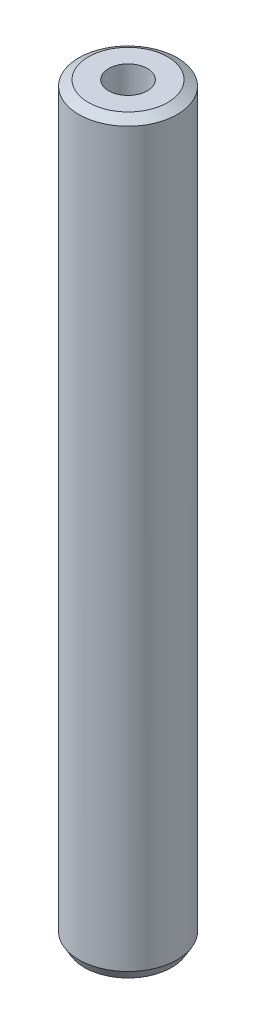
ISO-10303-21;
HEADER;
FILE_DESCRIPTION(('STEP AP214'),'2;1');
FILE_NAME('part.step','',(''),(''),'','','');
FILE_SCHEMA(('AUTOMOTIVE_DESIGN { 1 0 10303 214 1 1 1 1 }'));
ENDSEC;
DATA;
#1=APPLICATION_CONTEXT('core data for automotive mechanical design processes');
#2=APPLICATION_PROTOCOL_DEFINITION('international standard','automotive_design',2000,#1);
#3=PRODUCT_CONTEXT('',#1,'mechanical');
#4=PRODUCT('Part','Part','',(#3));
#5=PRODUCT_RELATED_PRODUCT_CATEGORY('part','',(#4));
#6=PRODUCT_DEFINITION_FORMATION('','',#4);
#7=PRODUCT_DEFINITION_CONTEXT('part definition',#1,'design');
#8=PRODUCT_DEFINITION('design','',#6,#7);
#9=PRODUCT_DEFINITION_SHAPE('','',#8);
#10=(LENGTH_UNIT() NAMED_UNIT(*) SI_UNIT(.MILLI.,.METRE.));
#11=(NAMED_UNIT(*) PLANE_ANGLE_UNIT() SI_UNIT($,.RADIAN.));
#12=(NAMED_UNIT(*) SI_UNIT($,.STERADIAN.) SOLID_ANGLE_UNIT());
#13=UNCERTAINTY_MEASURE_WITH_UNIT(LENGTH_MEASURE(1.E-05),#10,'distance_accuracy_value','');
#14=(GEOMETRIC_REPRESENTATION_CONTEXT(3) GLOBAL_UNCERTAINTY_ASSIGNED_CONTEXT((#13)) GLOBAL_UNIT_ASSIGNED_CONTEXT((#10,
#11,#12)) REPRESENTATION_CONTEXT('',''));
#15=CARTESIAN_POINT('',(0.,0.,0.));
#16=DIRECTION('',(0.,0.,1.));
#17=DIRECTION('',(1.,0.,0.));
#18=AXIS2_PLACEMENT_3D('',#15,#16,#17);
#19=CARTESIAN_POINT('',(0.,417.847683624445,0.));
#20=DIRECTION('',(0.,-1.,0.));
#21=DIRECTION('',(0.,0.,-1.));
#22=AXIS2_PLACEMENT_3D('',#19,#20,#21);
#23=CYLINDRICAL_SURFACE('',#22,27.5);
#24=CARTESIAN_POINT('',(0.,414.725845163587,0.));
#25=DIRECTION('',(0.,1.,0.));
#26=DIRECTION('',(0.,0.,1.));
#27=AXIS2_PLACEMENT_3D('',#24,#25,#26);
#28=CIRCLE('',#27,27.5);
#29=CARTESIAN_POINT('',(0.,414.725845163587,-27.5));
#30=VERTEX_POINT('',#29);
#31=EDGE_CURVE('E50',#30,#30,#28,.F.);
#32=CARTESIAN_POINT('',(0.,5.34554521155284,0.));
#33=DIRECTION('',(0.,1.,0.));
#34=DIRECTION('',(0.,0.,1.));
#35=AXIS2_PLACEMENT_3D('',#32,#33,#34);
#36=CIRCLE('',#35,27.5);
#37=CARTESIAN_POINT('',(0.,5.34554521155284,-27.5));
#38=VERTEX_POINT('',#37);
#39=EDGE_CURVE('E51',#38,#38,#36,.T.);
#40=CARTESIAN_POINT('',(0.,414.725845163587,-27.5));
#41=CARTESIAN_POINT('',(0.,410.461467039087,-27.5));
#42=CARTESIAN_POINT('',(0.,406.197088914587,-27.5));
#43=CARTESIAN_POINT('',(0.,397.668332665586,-27.5));
#44=CARTESIAN_POINT('',(0.,393.403954541085,-27.5));
#45=CARTESIAN_POINT('',(0.,384.875198292085,-27.5));
#46=CARTESIAN_POINT('',(0.,380.610820167584,-27.5));
#47=CARTESIAN_POINT('',(0.,372.082063918584,-27.5));
#48=CARTESIAN_POINT('',(0.,367.817685794083,-27.5));
#49=CARTESIAN_POINT('',(0.,359.288929545083,-27.5));
#50=CARTESIAN_POINT('',(0.,355.024551420582,-27.5));
#51=CARTESIAN_POINT('',(0.,346.495795171581,-27.5));
#52=CARTESIAN_POINT('',(0.,342.231417047081,-27.5));
#53=CARTESIAN_POINT('',(0.,333.70266079808,-27.5));
#54=CARTESIAN_POINT('',(0.,329.43828267358,-27.5));
#55=CARTESIAN_POINT('',(0.,320.909526424579,-27.5));
#56=CARTESIAN_POINT('',(0.,316.645148300079,-27.5));
#57=CARTESIAN_POINT('',(0.,308.116392051078,-27.5));
#58=CARTESIAN_POINT('',(0.,303.852013926578,-27.5));
#59=CARTESIAN_POINT('',(0.,295.323257677577,-27.5));
#60=CARTESIAN_POINT('',(0.,291.058879553077,-27.5));
#61=CARTESIAN_POINT('',(0.,282.530123304076,-27.5));
#62=CARTESIAN_POINT('',(0.,278.265745179576,-27.5));
#63=CARTESIAN_POINT('',(0.,269.736988930575,-27.5));
#64=CARTESIAN_POINT('',(0.,265.472610806075,-27.5));
#65=CARTESIAN_POINT('',(0.,256.943854557074,-27.5));
#66=CARTESIAN_POINT('',(0.,252.679476432574,-27.5));
#67=CARTESIAN_POINT('',(0.,244.150720183573,-27.5));
#68=CARTESIAN_POINT('',(0.,239.886342059073,-27.5));
#69=CARTESIAN_POINT('',(0.,231.357585810072,-27.5));
#70=CARTESIAN_POINT('',(0.,227.093207685571,-27.5));
#71=CARTESIAN_POINT('',(0.,218.564451436571,-27.5));
#72=CARTESIAN_POINT('',(0.,214.30007331207,-27.5));
#73=CARTESIAN_POINT('',(0.,205.77131706307,-27.5));
#74=CARTESIAN_POINT('',(0.,201.506938938569,-27.5));
#75=CARTESIAN_POINT('',(0.,192.978182689569,-27.5));
#76=CARTESIAN_POINT('',(0.,188.713804565068,-27.5));
#77=CARTESIAN_POINT('',(0.,180.185048316068,-27.5));
#78=CARTESIAN_POINT('',(0.,175.920670191567,-27.5));
#79=CARTESIAN_POINT('',(0.,167.391913942566,-27.5));
#80=CARTESIAN_POINT('',(0.,163.127535818066,-27.5));
#81=CARTESIAN_POINT('',(0.,154.598779569065,-27.5));
#82=CARTESIAN_POINT('',(0.,150.334401444565,-27.5));
#83=CARTESIAN_POINT('',(0.,141.805645195564,-27.5));
#84=CARTESIAN_POINT('',(0.,137.541267071064,-27.5));
#85=CARTESIAN_POINT('',(0.,129.012510822063,-27.5));
#86=CARTESIAN_POINT('',(0.,124.748132697563,-27.5));
#87=CARTESIAN_POINT('',(0.,116.219376448562,-27.5));
#88=CARTESIAN_POINT('',(0.,111.954998324062,-27.5));
#89=CARTESIAN_POINT('',(0.,103.426242075061,-27.5));
#90=CARTESIAN_POINT('',(0.,99.1618639505607,-27.5));
#91=CARTESIAN_POINT('',(0.,90.63310770156,-27.5));
#92=CARTESIAN_POINT('',(0.,86.3687295770597,-27.5));
#93=CARTESIAN_POINT('',(0.,77.8399733280589,-27.5));
#94=CARTESIAN_POINT('',(0.,73.5755952035585,-27.5));
#95=CARTESIAN_POINT('',(0.,65.0468389545578,-27.5));
#96=CARTESIAN_POINT('',(0.,60.7824608300575,-27.5));
#97=CARTESIAN_POINT('',(0.,52.2537045810568,-27.5));
#98=CARTESIAN_POINT('',(0.,47.9893264565564,-27.5));
#99=CARTESIAN_POINT('',(0.,39.4605702075557,-27.5));
#100=CARTESIAN_POINT('',(0.,35.1961920830554,-27.5));
#101=CARTESIAN_POINT('',(0.,26.6674358340546,-27.5));
#102=CARTESIAN_POINT('',(0.,22.4030577095543,-27.5));
#103=CARTESIAN_POINT('',(0.,13.8743014605535,-27.5));
#104=CARTESIAN_POINT('',(0.,9.60992333605319,-27.5));
#105=CARTESIAN_POINT('',(0.,5.34554521155284,-27.5));
#106=B_SPLINE_CURVE_WITH_KNOTS('',3,(#40,#41,#42,#43,#44,#45,#46,#47,#48,#49,#50,#51,#52,#53,
#54,#55,#56,#57,#58,#59,#60,#61,#62,#63,#64,#65,#66,#67,#68,#69,#70,#71,#72,#73,#74,#75,#76,#77,
#78,#79,#80,#81,#82,#83,#84,#85,#86,#87,#88,#89,#90,#91,#92,#93,#94,#95,#96,#97,#98,#99,#100,
#101,#102,#103,#104,#105),.UNSPECIFIED.,.F.,.F.,(4,2,2,2,2,2,2,2,2,2,2,2,2,2,2,2,2,2,2,2,2,2,2,
2,2,2,2,2,2,2,2,2,4),(0.,12.793134373501,25.5862687470021,38.3794031205032,51.1725374940042,
63.9656718675053,76.7588062410064,89.5519406145075,102.345074988009,115.13820936151,
127.931343735011,140.724478108512,153.517612482013,166.310746855514,179.103881229015,
191.897015602516,204.690149976017,217.483284349518,230.276418723019,243.06955309652,
255.862687470021,268.655821843523,281.448956217024,294.242090590525,307.035224964026,
319.828359337527,332.621493711028,345.414628084529,358.20776245803,371.000896831531,
383.794031205032,396.587165578533,409.380299952034),.UNSPECIFIED.);
#107=EDGE_CURVE('BSEAM39',#30,#38,#106,.T.);
#108=ORIENTED_EDGE('',*,*,#31,.T.);
#109=ORIENTED_EDGE('',*,*,#39,.T.);
#110=ORIENTED_EDGE('',*,*,#107,.T.);
#111=ORIENTED_EDGE('',*,*,#107,.F.);
#112=EDGE_LOOP('',(#108,#110,#109,#111));
#113=FACE_BOUND('',#112,.T.);
#114=ADVANCED_FACE('F39',(#113),#23,.T.);
#115=CARTESIAN_POINT('',(0.,417.847683624445,0.));
#116=DIRECTION('',(0.,1.,0.));
#117=DIRECTION('',(0.,0.,1.));
#118=AXIS2_PLACEMENT_3D('',#115,#116,#117);
#119=PLANE('',#118);
#120=CARTESIAN_POINT('',(0.,417.847683624445,0.));
#121=DIRECTION('',(0.,1.,0.));
#122=DIRECTION('',(0.,0.,1.));
#123=AXIS2_PLACEMENT_3D('',#120,#121,#122);
#124=CIRCLE('',#123,22.1544547884483);
#125=CARTESIAN_POINT('',(0.,417.847683624445,22.1544547884483));
#126=VERTEX_POINT('',#125);
#127=EDGE_CURVE('E54',#126,#126,#124,.T.);
#128=ORIENTED_EDGE('',*,*,#127,.T.);
#129=EDGE_LOOP('',(#128));
#130=FACE_BOUND('',#129,.T.);
#131=CARTESIAN_POINT('',(0.,417.847683624445,0.));
#132=DIRECTION('',(0.,1.,0.));
#133=DIRECTION('',(0.,0.,1.));
#134=AXIS2_PLACEMENT_3D('',#131,#132,#133);
#135=CIRCLE('',#134,10.823938452716);
#136=CARTESIAN_POINT('',(0.,417.847683624445,-10.823938452716));
#137=VERTEX_POINT('',#136);
#138=EDGE_CURVE('E58',#137,#137,#135,.T.);
#139=ORIENTED_EDGE('',*,*,#138,.F.);
#140=EDGE_LOOP('',(#139));
#141=FACE_BOUND('',#140,.T.);
#142=ADVANCED_FACE('F69',(#130,#141),#119,.T.);
#143=CARTESIAN_POINT('',(0.,0.,0.));
#144=DIRECTION('',(0.,1.,0.));
#145=DIRECTION('',(0.,0.,1.));
#146=AXIS2_PLACEMENT_3D('',#143,#144,#145);
#147=PLANE('',#146);
#148=CARTESIAN_POINT('',(0.,0.,0.));
#149=DIRECTION('',(0.,1.,0.));
#150=DIRECTION('',(0.,0.,1.));
#151=AXIS2_PLACEMENT_3D('',#148,#149,#150);
#152=CIRCLE('',#151,24.3781615391417);
#153=CARTESIAN_POINT('',(0.,0.,24.3781615391417));
#154=VERTEX_POINT('',#153);
#155=EDGE_CURVE('E10',#154,#154,#152,.F.);
#156=ORIENTED_EDGE('',*,*,#155,.T.);
#157=EDGE_LOOP('',(#156));
#158=FACE_BOUND('',#157,.T.);
#159=CARTESIAN_POINT('',(0.,0.,0.));
#160=DIRECTION('',(0.,1.,0.));
#161=DIRECTION('',(0.,0.,1.));
#162=AXIS2_PLACEMENT_3D('',#159,#160,#161);
#163=CIRCLE('',#162,10.823938452716);
#164=CARTESIAN_POINT('',(0.,0.,-10.823938452716));
#165=VERTEX_POINT('',#164);
#166=EDGE_CURVE('E63',#165,#165,#163,.T.);
#167=ORIENTED_EDGE('',*,*,#166,.T.);
#168=EDGE_LOOP('',(#167));
#169=FACE_BOUND('',#168,.T.);
#170=ADVANCED_FACE('F75',(#158,#169),#147,.F.);
#171=CARTESIAN_POINT('',(0.,417.847683624445,0.));
#172=DIRECTION('',(0.,-1.,0.));
#173=DIRECTION('',(0.,0.,-1.));
#174=AXIS2_PLACEMENT_3D('',#171,#172,#173);
#175=CYLINDRICAL_SURFACE('',#174,10.823938452716);
#176=CARTESIAN_POINT('',(0.,417.847683624445,-10.823938452716));
#177=CARTESIAN_POINT('',(0.,413.49510358669,-10.823938452716));
#178=CARTESIAN_POINT('',(0.,409.142523548936,-10.823938452716));
#179=CARTESIAN_POINT('',(0.,400.437363473426,-10.823938452716));
#180=CARTESIAN_POINT('',(0.,396.084783435672,-10.823938452716));
#181=CARTESIAN_POINT('',(0.,387.379623360162,-10.823938452716));
#182=CARTESIAN_POINT('',(0.,383.027043322408,-10.823938452716));
#183=CARTESIAN_POINT('',(0.,374.321883246899,-10.823938452716));
#184=CARTESIAN_POINT('',(0.,369.969303209144,-10.823938452716));
#185=CARTESIAN_POINT('',(0.,361.264143133635,-10.823938452716));
#186=CARTESIAN_POINT('',(0.,356.91156309588,-10.823938452716));
#187=CARTESIAN_POINT('',(0.,348.206403020371,-10.823938452716));
#188=CARTESIAN_POINT('',(0.,343.853822982616,-10.823938452716));
#189=CARTESIAN_POINT('',(0.,335.148662907107,-10.823938452716));
#190=CARTESIAN_POINT('',(0.,330.796082869352,-10.823938452716));
#191=CARTESIAN_POINT('',(0.,322.090922793843,-10.823938452716));
#192=CARTESIAN_POINT('',(0.,317.738342756088,-10.823938452716));
#193=CARTESIAN_POINT('',(0.,309.033182680579,-10.823938452716));
#194=CARTESIAN_POINT('',(0.,304.680602642824,-10.823938452716));
#195=CARTESIAN_POINT('',(0.,295.975442567315,-10.823938452716));
#196=CARTESIAN_POINT('',(0.,291.62286252956,-10.823938452716));
#197=CARTESIAN_POINT('',(0.,282.917702454051,-10.823938452716));
#198=CARTESIAN_POINT('',(0.,278.565122416297,-10.823938452716));
#199=CARTESIAN_POINT('',(0.,269.859962340787,-10.823938452716));
#200=CARTESIAN_POINT('',(0.,265.507382303033,-10.823938452716));
#201=CARTESIAN_POINT('',(0.,256.802222227523,-10.823938452716));
#202=CARTESIAN_POINT('',(0.,252.449642189769,-10.823938452716));
#203=CARTESIAN_POINT('',(0.,243.744482114259,-10.823938452716));
#204=CARTESIAN_POINT('',(0.,239.391902076505,-10.823938452716));
#205=CARTESIAN_POINT('',(0.,230.686742000996,-10.823938452716));
#206=CARTESIAN_POINT('',(0.,226.334161963241,-10.823938452716));
#207=CARTESIAN_POINT('',(0.,217.629001887732,-10.823938452716));
#208=CARTESIAN_POINT('',(0.,213.276421849977,-10.823938452716));
#209=CARTESIAN_POINT('',(0.,204.571261774468,-10.823938452716));
#210=CARTESIAN_POINT('',(0.,200.218681736713,-10.823938452716));
#211=CARTESIAN_POINT('',(0.,191.513521661204,-10.823938452716));
#212=CARTESIAN_POINT('',(0.,187.160941623449,-10.823938452716));
#213=CARTESIAN_POINT('',(0.,178.45578154794,-10.823938452716));
#214=CARTESIAN_POINT('',(0.,174.103201510185,-10.823938452716));
#215=CARTESIAN_POINT('',(0.,165.398041434676,-10.823938452716));
#216=CARTESIAN_POINT('',(0.,161.045461396921,-10.823938452716));
#217=CARTESIAN_POINT('',(0.,152.340301321412,-10.823938452716));
#218=CARTESIAN_POINT('',(0.,147.987721283658,-10.823938452716));
#219=CARTESIAN_POINT('',(0.,139.282561208148,-10.823938452716));
#220=CARTESIAN_POINT('',(0.,134.929981170394,-10.823938452716));
#221=CARTESIAN_POINT('',(0.,126.224821094884,-10.823938452716));
#222=CARTESIAN_POINT('',(0.,121.87224105713,-10.823938452716));
#223=CARTESIAN_POINT('',(0.,113.16708098162,-10.823938452716));
#224=CARTESIAN_POINT('',(0.,108.814500943866,-10.823938452716));
#225=CARTESIAN_POINT('',(0.,100.109340868357,-10.823938452716));
#226=CARTESIAN_POINT('',(0.,95.756760830602,-10.823938452716));
#227=CARTESIAN_POINT('',(0.,87.0516007550927,-10.823938452716));
#228=CARTESIAN_POINT('',(0.,82.699020717338,-10.823938452716));
#229=CARTESIAN_POINT('',(0.,73.9938606418288,-10.823938452716));
#230=CARTESIAN_POINT('',(0.,69.6412806040742,-10.823938452716));
#231=CARTESIAN_POINT('',(0.,60.9361205285649,-10.823938452716));
#232=CARTESIAN_POINT('',(0.,56.5835404908103,-10.823938452716));
#233=CARTESIAN_POINT('',(0.,47.878380415301,-10.823938452716));
#234=CARTESIAN_POINT('',(0.,43.5258003775463,-10.823938452716));
#235=CARTESIAN_POINT('',(0.,34.8206403020371,-10.823938452716));
#236=CARTESIAN_POINT('',(0.,30.4680602642824,-10.823938452716));
#237=CARTESIAN_POINT('',(0.,21.7629001887732,-10.823938452716));
#238=CARTESIAN_POINT('',(0.,17.4103201510185,-10.823938452716));
#239=CARTESIAN_POINT('',(0.,8.70516007550926,-10.823938452716));
#240=CARTESIAN_POINT('',(0.,4.35258003775463,-10.823938452716));
#241=CARTESIAN_POINT('',(0.,0.,-10.823938452716));
#242=B_SPLINE_CURVE_WITH_KNOTS('',3,(#176,#177,#178,#179,#180,#181,#182,#183,#184,#185,#186,
#187,#188,#189,#190,#191,#192,#193,#194,#195,#196,#197,#198,#199,#200,#201,#202,#203,#204,#205,
#206,#207,#208,#209,#210,#211,#212,#213,#214,#215,#216,#217,#218,#219,#220,#221,#222,#223,#224,
#225,#226,#227,#228,#229,#230,#231,#232,#233,#234,#235,#236,#237,#238,#239,#240,#241),
.UNSPECIFIED.,.F.,.F.,(4,2,2,2,2,2,2,2,2,2,2,2,2,2,2,2,2,2,2,2,2,2,2,2,2,2,2,2,2,2,2,2,4),(0.,
13.0577401132639,26.1154802265278,39.1732203397917,52.2309604530556,65.2887005663195,
78.3464406795835,91.4041807928473,104.461920906111,117.519661019375,130.577401132639,
143.635141245903,156.692881359167,169.750621472431,182.808361585695,195.866101698959,
208.923841812222,221.981581925486,235.03932203875,248.097062152014,261.154802265278,
274.212542378542,287.270282491806,300.32802260507,313.385762718334,326.443502831598,
339.501242944861,352.558983058125,365.616723171389,378.674463284653,391.732203397917,
404.789943511181,417.847683624445),.UNSPECIFIED.);
#243=EDGE_CURVE('BSEAM70',#137,#165,#242,.T.);
#244=ORIENTED_EDGE('',*,*,#138,.T.);
#245=ORIENTED_EDGE('',*,*,#166,.F.);
#246=ORIENTED_EDGE('',*,*,#243,.T.);
#247=ORIENTED_EDGE('',*,*,#243,.F.);
#248=EDGE_LOOP('',(#244,#246,#245,#247));
#249=FACE_BOUND('',#248,.T.);
#250=ADVANCED_FACE('F70',(#249),#175,.F.);
#251=CARTESIAN_POINT('',(0.,417.847683624445,0.));
#252=DIRECTION('',(0.,-1.,0.));
#253=DIRECTION('',(0.,0.,-1.));
#254=AXIS2_PLACEMENT_3D('',#251,#252,#253);
#255=CONICAL_SURFACE('',#254,22.1544547884483,1.04221902555946);
#256=ORIENTED_EDGE('',*,*,#31,.F.);
#257=EDGE_LOOP('',(#256));
#258=FACE_BOUND('',#257,.T.);
#259=ORIENTED_EDGE('',*,*,#127,.F.);
#260=EDGE_LOOP('',(#259));
#261=FACE_BOUND('',#260,.T.);
#262=ADVANCED_FACE('F81',(#258,#261),#255,.T.);
#263=CARTESIAN_POINT('',(0.,5.34554521155284,0.));
#264=DIRECTION('',(0.,1.,0.));
#265=DIRECTION('',(0.,0.,1.));
#266=AXIS2_PLACEMENT_3D('',#263,#264,#265);
#267=CONICAL_SURFACE('',#266,27.5,0.528577301235432);
#268=ORIENTED_EDGE('',*,*,#155,.F.);
#269=EDGE_LOOP('',(#268));
#270=FACE_BOUND('',#269,.T.);
#271=ORIENTED_EDGE('',*,*,#39,.F.);
#272=EDGE_LOOP('',(#271));
#273=FACE_BOUND('',#272,.T.);
#274=ADVANCED_FACE('F45',(#270,#273),#267,.T.);
#275=CLOSED_SHELL('',(#114,#142,#170,#250,#262,#274));
#276=MANIFOLD_SOLID_BREP('B2',#275);
#277=ADVANCED_BREP_SHAPE_REPRESENTATION('',(#18,#276),#14);
#278=SHAPE_DEFINITION_REPRESENTATION(#9,#277);
ENDSEC;
END-ISO-10303-21;
